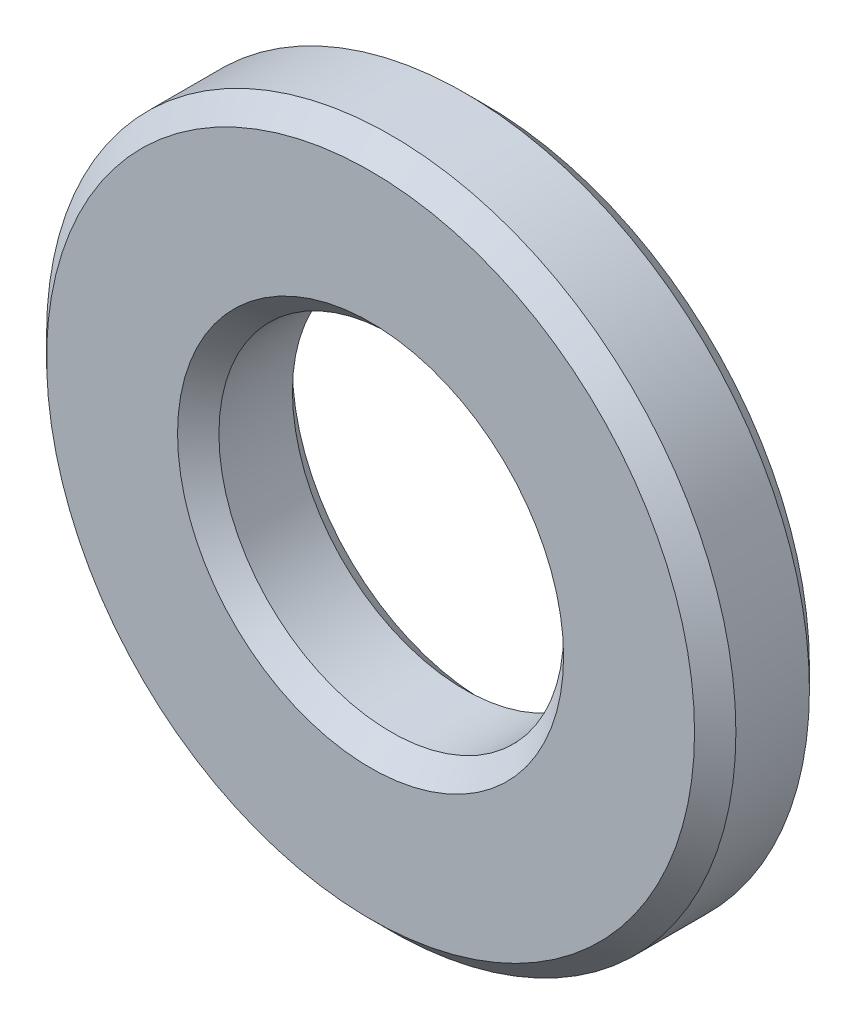
ISO-10303-21;
HEADER;
FILE_DESCRIPTION(('STEP AP214'),'2;1');
FILE_NAME('part.step','',(''),(''),'','','');
FILE_SCHEMA(('AUTOMOTIVE_DESIGN { 1 0 10303 214 1 1 1 1 }'));
ENDSEC;
DATA;
#1=APPLICATION_CONTEXT('core data for automotive mechanical design processes');
#2=APPLICATION_PROTOCOL_DEFINITION('international standard','automotive_design',2000,#1);
#3=PRODUCT_CONTEXT('',#1,'mechanical');
#4=PRODUCT('Part','Part','',(#3));
#5=PRODUCT_RELATED_PRODUCT_CATEGORY('part','',(#4));
#6=PRODUCT_DEFINITION_FORMATION('','',#4);
#7=PRODUCT_DEFINITION_CONTEXT('part definition',#1,'design');
#8=PRODUCT_DEFINITION('design','',#6,#7);
#9=PRODUCT_DEFINITION_SHAPE('','',#8);
#10=(LENGTH_UNIT() NAMED_UNIT(*) SI_UNIT(.MILLI.,.METRE.));
#11=(NAMED_UNIT(*) PLANE_ANGLE_UNIT() SI_UNIT($,.RADIAN.));
#12=(NAMED_UNIT(*) SI_UNIT($,.STERADIAN.) SOLID_ANGLE_UNIT());
#13=UNCERTAINTY_MEASURE_WITH_UNIT(LENGTH_MEASURE(1.E-05),#10,'distance_accuracy_value','');
#14=(GEOMETRIC_REPRESENTATION_CONTEXT(3) GLOBAL_UNCERTAINTY_ASSIGNED_CONTEXT((#13)) GLOBAL_UNIT_ASSIGNED_CONTEXT((#10,
#11,#12)) REPRESENTATION_CONTEXT('',''));
#15=CARTESIAN_POINT('',(0.,0.,0.));
#16=DIRECTION('',(0.,0.,1.));
#17=DIRECTION('',(1.,0.,0.));
#18=AXIS2_PLACEMENT_3D('',#15,#16,#17);
#19=CARTESIAN_POINT('',(0.,0.,-3.175));
#20=DIRECTION('',(0.,0.,1.));
#21=DIRECTION('',(1.,0.,0.));
#22=AXIS2_PLACEMENT_3D('',#19,#20,#21);
#23=CYLINDRICAL_SURFACE('',#22,19.05);
#24=CARTESIAN_POINT('',(0.,0.,-2.032));
#25=DIRECTION('',(0.,0.,1.));
#26=DIRECTION('',(1.,0.,0.));
#27=AXIS2_PLACEMENT_3D('',#24,#25,#26);
#28=CIRCLE('',#27,19.05);
#29=CARTESIAN_POINT('',(19.05,0.,-2.032));
#30=VERTEX_POINT('',#29);
#31=EDGE_CURVE('E10',#30,#30,#28,.T.);
#32=ORIENTED_EDGE('',*,*,#31,.T.);
#33=EDGE_LOOP('',(#32));
#34=FACE_BOUND('',#33,.T.);
#35=CARTESIAN_POINT('',(0.,0.,2.032));
#36=DIRECTION('',(0.,0.,1.));
#37=DIRECTION('',(1.,0.,0.));
#38=AXIS2_PLACEMENT_3D('',#35,#36,#37);
#39=CIRCLE('',#38,19.05);
#40=CARTESIAN_POINT('',(19.05,0.,2.032));
#41=VERTEX_POINT('',#40);
#42=EDGE_CURVE('E39',#41,#41,#39,.F.);
#43=ORIENTED_EDGE('',*,*,#42,.T.);
#44=EDGE_LOOP('',(#43));
#45=FACE_BOUND('',#44,.T.);
#46=ADVANCED_FACE('F32',(#34,#45),#23,.T.);
#47=CARTESIAN_POINT('',(0.,0.,-3.175));
#48=DIRECTION('',(0.,0.,1.));
#49=DIRECTION('',(1.,0.,0.));
#50=AXIS2_PLACEMENT_3D('',#47,#48,#49);
#51=PLANE('',#50);
#52=CARTESIAN_POINT('',(0.,0.,-3.175));
#53=DIRECTION('',(0.,0.,1.));
#54=DIRECTION('',(1.,0.,0.));
#55=AXIS2_PLACEMENT_3D('',#52,#53,#54);
#56=CIRCLE('',#55,10.668);
#57=CARTESIAN_POINT('',(10.668,0.,-3.175));
#58=VERTEX_POINT('',#57);
#59=EDGE_CURVE('E58',#58,#58,#56,.T.);
#60=ORIENTED_EDGE('',*,*,#59,.T.);
#61=EDGE_LOOP('',(#60));
#62=FACE_BOUND('',#61,.T.);
#63=CARTESIAN_POINT('',(0.,0.,-3.175));
#64=DIRECTION('',(0.,0.,1.));
#65=DIRECTION('',(1.,0.,0.));
#66=AXIS2_PLACEMENT_3D('',#63,#64,#65);
#67=CIRCLE('',#66,17.907);
#68=CARTESIAN_POINT('',(17.907,0.,-3.175));
#69=VERTEX_POINT('',#68);
#70=EDGE_CURVE('E61',#69,#69,#67,.F.);
#71=ORIENTED_EDGE('',*,*,#70,.T.);
#72=EDGE_LOOP('',(#71));
#73=FACE_BOUND('',#72,.T.);
#74=ADVANCED_FACE('F65',(#62,#73),#51,.F.);
#75=CARTESIAN_POINT('',(0.,0.,-3.175));
#76=DIRECTION('',(0.,0.,1.));
#77=DIRECTION('',(1.,0.,0.));
#78=AXIS2_PLACEMENT_3D('',#75,#76,#77);
#79=CYLINDRICAL_SURFACE('',#78,9.525);
#80=CARTESIAN_POINT('',(0.,0.,-2.03199999999999));
#81=DIRECTION('',(0.,0.,1.));
#82=DIRECTION('',(1.,0.,0.));
#83=AXIS2_PLACEMENT_3D('',#80,#81,#82);
#84=CIRCLE('',#83,9.525);
#85=CARTESIAN_POINT('',(9.525,0.,-2.03199999999999));
#86=VERTEX_POINT('',#85);
#87=EDGE_CURVE('E52',#86,#86,#84,.F.);
#88=ORIENTED_EDGE('',*,*,#87,.T.);
#89=EDGE_LOOP('',(#88));
#90=FACE_BOUND('',#89,.T.);
#91=CARTESIAN_POINT('',(0.,0.,2.032));
#92=DIRECTION('',(0.,0.,1.));
#93=DIRECTION('',(1.,0.,0.));
#94=AXIS2_PLACEMENT_3D('',#91,#92,#93);
#95=CIRCLE('',#94,9.525);
#96=CARTESIAN_POINT('',(9.525,0.,2.032));
#97=VERTEX_POINT('',#96);
#98=EDGE_CURVE('E55',#97,#97,#95,.T.);
#99=ORIENTED_EDGE('',*,*,#98,.T.);
#100=EDGE_LOOP('',(#99));
#101=FACE_BOUND('',#100,.T.);
#102=ADVANCED_FACE('F84',(#90,#101),#79,.F.);
#103=CARTESIAN_POINT('',(0.,0.,3.175));
#104=DIRECTION('',(0.,0.,1.));
#105=DIRECTION('',(1.,0.,0.));
#106=AXIS2_PLACEMENT_3D('',#103,#104,#105);
#107=PLANE('',#106);
#108=CARTESIAN_POINT('',(0.,0.,3.175));
#109=DIRECTION('',(0.,0.,1.));
#110=DIRECTION('',(1.,0.,0.));
#111=AXIS2_PLACEMENT_3D('',#108,#109,#110);
#112=CIRCLE('',#111,10.668);
#113=CARTESIAN_POINT('',(10.668,0.,3.175));
#114=VERTEX_POINT('',#113);
#115=EDGE_CURVE('E43',#114,#114,#112,.F.);
#116=ORIENTED_EDGE('',*,*,#115,.T.);
#117=EDGE_LOOP('',(#116));
#118=FACE_BOUND('',#117,.T.);
#119=CARTESIAN_POINT('',(0.,0.,3.175));
#120=DIRECTION('',(0.,0.,1.));
#121=DIRECTION('',(1.,0.,0.));
#122=AXIS2_PLACEMENT_3D('',#119,#120,#121);
#123=CIRCLE('',#122,17.907);
#124=CARTESIAN_POINT('',(17.907,0.,3.175));
#125=VERTEX_POINT('',#124);
#126=EDGE_CURVE('E47',#125,#125,#123,.T.);
#127=ORIENTED_EDGE('',*,*,#126,.T.);
#128=EDGE_LOOP('',(#127));
#129=FACE_BOUND('',#128,.T.);
#130=ADVANCED_FACE('F90',(#118,#129),#107,.T.);
#131=CARTESIAN_POINT('',(0.,0.,-3.175));
#132=DIRECTION('',(0.,0.,-1.));
#133=DIRECTION('',(-1.,0.,0.));
#134=AXIS2_PLACEMENT_3D('',#131,#132,#133);
#135=CONICAL_SURFACE('',#134,10.668,0.785398163397449);
#136=ORIENTED_EDGE('',*,*,#87,.F.);
#137=EDGE_LOOP('',(#136));
#138=FACE_BOUND('',#137,.T.);
#139=ORIENTED_EDGE('',*,*,#59,.F.);
#140=EDGE_LOOP('',(#139));
#141=FACE_BOUND('',#140,.T.);
#142=ADVANCED_FACE('F76',(#138,#141),#135,.F.);
#143=CARTESIAN_POINT('',(0.,0.,2.032));
#144=DIRECTION('',(0.,0.,1.));
#145=DIRECTION('',(1.,0.,0.));
#146=AXIS2_PLACEMENT_3D('',#143,#144,#145);
#147=CONICAL_SURFACE('',#146,9.525,0.785398163397451);
#148=ORIENTED_EDGE('',*,*,#115,.F.);
#149=EDGE_LOOP('',(#148));
#150=FACE_BOUND('',#149,.T.);
#151=ORIENTED_EDGE('',*,*,#98,.F.);
#152=EDGE_LOOP('',(#151));
#153=FACE_BOUND('',#152,.T.);
#154=ADVANCED_FACE('F70',(#150,#153),#147,.F.);
#155=CARTESIAN_POINT('',(0.,0.,-2.032));
#156=DIRECTION('',(0.,0.,1.));
#157=DIRECTION('',(1.,0.,0.));
#158=AXIS2_PLACEMENT_3D('',#155,#156,#157);
#159=CONICAL_SURFACE('',#158,19.05,0.78539816339745);
#160=ORIENTED_EDGE('',*,*,#70,.F.);
#161=EDGE_LOOP('',(#160));
#162=FACE_BOUND('',#161,.T.);
#163=ORIENTED_EDGE('',*,*,#31,.F.);
#164=EDGE_LOOP('',(#163));
#165=FACE_BOUND('',#164,.T.);
#166=ADVANCED_FACE('F67',(#162,#165),#159,.T.);
#167=CARTESIAN_POINT('',(0.,0.,3.175));
#168=DIRECTION('',(0.,0.,-1.));
#169=DIRECTION('',(-1.,0.,0.));
#170=AXIS2_PLACEMENT_3D('',#167,#168,#169);
#171=CONICAL_SURFACE('',#170,17.907,0.785398163397447);
#172=ORIENTED_EDGE('',*,*,#42,.F.);
#173=EDGE_LOOP('',(#172));
#174=FACE_BOUND('',#173,.T.);
#175=ORIENTED_EDGE('',*,*,#126,.F.);
#176=EDGE_LOOP('',(#175));
#177=FACE_BOUND('',#176,.T.);
#178=ADVANCED_FACE('F34',(#174,#177),#171,.T.);
#179=CLOSED_SHELL('',(#46,#74,#102,#130,#142,#154,#166,#178));
#180=MANIFOLD_SOLID_BREP('B2',#179);
#181=ADVANCED_BREP_SHAPE_REPRESENTATION('',(#18,#180),#14);
#182=SHAPE_DEFINITION_REPRESENTATION(#9,#181);
ENDSEC;
END-ISO-10303-21;
